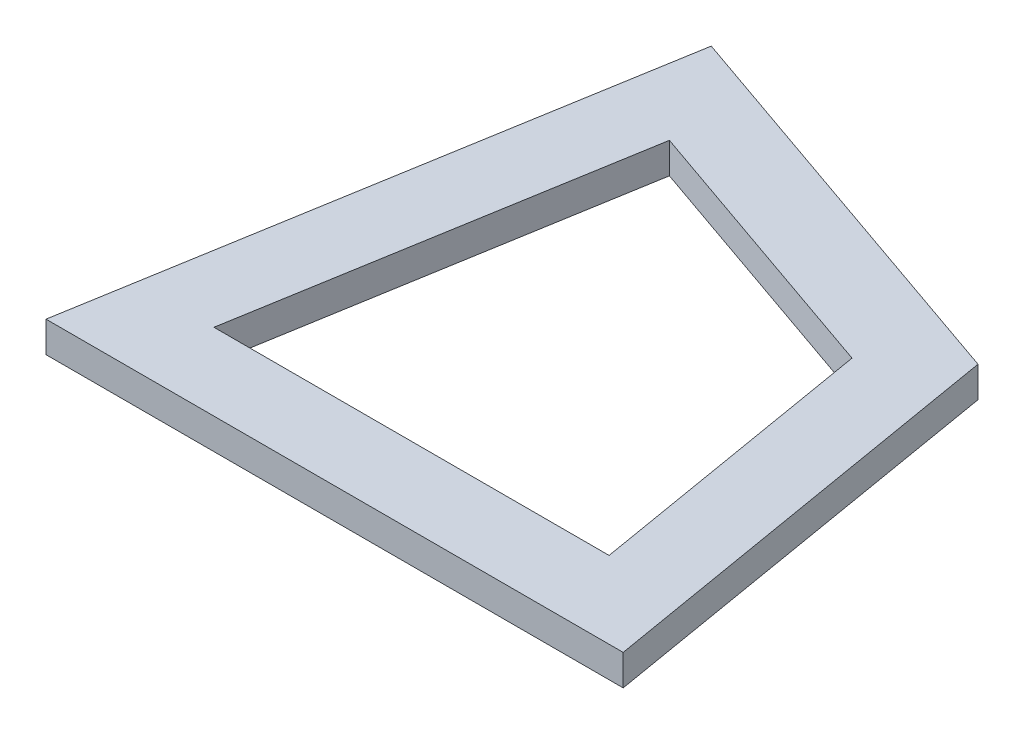
ISO-10303-21;
HEADER;
FILE_DESCRIPTION(('STEP AP214'),'2;1');
FILE_NAME('part.step','',(''),(''),'','','');
FILE_SCHEMA(('AUTOMOTIVE_DESIGN { 1 0 10303 214 1 1 1 1 }'));
ENDSEC;
DATA;
#1=APPLICATION_CONTEXT('core data for automotive mechanical design processes');
#2=APPLICATION_PROTOCOL_DEFINITION('international standard','automotive_design',2000,#1);
#3=PRODUCT_CONTEXT('',#1,'mechanical');
#4=PRODUCT('Part','Part','',(#3));
#5=PRODUCT_RELATED_PRODUCT_CATEGORY('part','',(#4));
#6=PRODUCT_DEFINITION_FORMATION('','',#4);
#7=PRODUCT_DEFINITION_CONTEXT('part definition',#1,'design');
#8=PRODUCT_DEFINITION('design','',#6,#7);
#9=PRODUCT_DEFINITION_SHAPE('','',#8);
#10=(LENGTH_UNIT() NAMED_UNIT(*) SI_UNIT(.MILLI.,.METRE.));
#11=(NAMED_UNIT(*) PLANE_ANGLE_UNIT() SI_UNIT($,.RADIAN.));
#12=(NAMED_UNIT(*) SI_UNIT($,.STERADIAN.) SOLID_ANGLE_UNIT());
#13=UNCERTAINTY_MEASURE_WITH_UNIT(LENGTH_MEASURE(1.E-05),#10,'distance_accuracy_value','');
#14=(GEOMETRIC_REPRESENTATION_CONTEXT(3) GLOBAL_UNCERTAINTY_ASSIGNED_CONTEXT((#13)) GLOBAL_UNIT_ASSIGNED_CONTEXT((#10,
#11,#12)) REPRESENTATION_CONTEXT('',''));
#15=CARTESIAN_POINT('',(0.,0.,0.));
#16=DIRECTION('',(0.,0.,1.));
#17=DIRECTION('',(1.,0.,0.));
#18=AXIS2_PLACEMENT_3D('',#15,#16,#17);
#19=CARTESIAN_POINT('',(0.,2.,0.));
#20=DIRECTION('',(0.,-1.,0.));
#21=DIRECTION('',(0.,0.,-1.));
#22=AXIS2_PLACEMENT_3D('',#19,#20,#21);
#23=PLANE('',#22);
#24=DIRECTION('',(-0.166596655404362,0.,0.986025128689974));
#25=VECTOR('',#24,1.);
#26=CARTESIAN_POINT('',(6.24939426390232,2.,-36.9878961155744));
#27=LINE('',#26,#25);
#28=CARTESIAN_POINT('',(6.24939426390232,2.,-36.9878961155744));
#29=VERTEX_POINT('',#28);
#30=CARTESIAN_POINT('',(0.,2.,0.));
#31=VERTEX_POINT('',#30);
#32=EDGE_CURVE('E140',#29,#31,#27,.T.);
#33=ORIENTED_EDGE('',*,*,#32,.T.);
#34=DIRECTION('',(1.,0.,0.));
#35=VECTOR('',#34,1.);
#36=CARTESIAN_POINT('',(0.,2.,0.));
#37=LINE('',#36,#35);
#38=CARTESIAN_POINT('',(37.51212321,2.,0.));
#39=VERTEX_POINT('',#38);
#40=EDGE_CURVE('E143',#31,#39,#37,.T.);
#41=ORIENTED_EDGE('',*,*,#40,.T.);
#42=DIRECTION('',(-0.166596655404362,0.,-0.986025128689974));
#43=VECTOR('',#42,1.);
#44=CARTESIAN_POINT('',(37.51212321,2.,0.));
#45=LINE('',#44,#43);
#46=CARTESIAN_POINT('',(32.8235622653046,2.,-27.7498902822694));
#47=VERTEX_POINT('',#46);
#48=EDGE_CURVE('E146',#39,#47,#45,.T.);
#49=ORIENTED_EDGE('',*,*,#48,.T.);
#50=DIRECTION('',(-0.944553945341675,0.,-0.328356276534311));
#51=VECTOR('',#50,1.);
#52=CARTESIAN_POINT('',(32.8235622653046,2.,-27.7498902822694));
#53=LINE('',#52,#51);
#54=EDGE_CURVE('E148',#47,#29,#53,.T.);
#55=ORIENTED_EDGE('',*,*,#54,.T.);
#56=EDGE_LOOP('',(#33,#41,#49,#55));
#57=FACE_BOUND('',#56,.T.);
#58=DIRECTION('',(-0.944553945341675,0.,-0.32835627653431));
#59=VECTOR('',#58,1.);
#60=CARTESIAN_POINT('',(28.3864635394444,2.,-23.9988596489901));
#61=LINE('',#60,#59);
#62=CARTESIAN_POINT('',(28.3864635394444,2.,-23.9988596489901));
#63=VERTEX_POINT('',#62);
#64=CARTESIAN_POINT('',(10.1941829697263,2.,-30.3230611824232));
#65=VERTEX_POINT('',#64);
#66=EDGE_CURVE('E104',#63,#65,#61,.T.);
#67=ORIENTED_EDGE('',*,*,#66,.F.);
#68=DIRECTION('',(-0.166596655404362,0.,-0.986025128689974));
#69=VECTOR('',#68,1.);
#70=CARTESIAN_POINT('',(31.5964694327261,2.,-5.));
#71=LINE('',#70,#69);
#72=CARTESIAN_POINT('',(31.5964694327261,2.,-5.));
#73=VERTEX_POINT('',#72);
#74=EDGE_CURVE('E126',#73,#63,#71,.T.);
#75=ORIENTED_EDGE('',*,*,#74,.F.);
#76=DIRECTION('',(1.,0.,0.));
#77=VECTOR('',#76,1.);
#78=CARTESIAN_POINT('',(5.91565377727388,2.,-5.));
#79=LINE('',#78,#77);
#80=CARTESIAN_POINT('',(5.91565377727388,2.,-5.));
#81=VERTEX_POINT('',#80);
#82=EDGE_CURVE('E124',#81,#73,#79,.T.);
#83=ORIENTED_EDGE('',*,*,#82,.F.);
#84=DIRECTION('',(-0.166596655404362,0.,0.986025128689974));
#85=VECTOR('',#84,1.);
#86=CARTESIAN_POINT('',(10.1941829697263,2.,-30.3230611824232));
#87=LINE('',#86,#85);
#88=EDGE_CURVE('E112',#65,#81,#87,.T.);
#89=ORIENTED_EDGE('',*,*,#88,.F.);
#90=EDGE_LOOP('',(#67,#75,#83,#89));
#91=FACE_BOUND('',#90,.T.);
#92=ADVANCED_FACE('F39',(#57,#91),#23,.F.);
#93=CARTESIAN_POINT('',(0.,0.,0.));
#94=DIRECTION('',(0.,-1.,0.));
#95=DIRECTION('',(0.,0.,-1.));
#96=AXIS2_PLACEMENT_3D('',#93,#94,#95);
#97=PLANE('',#96);
#98=DIRECTION('',(-0.166596655404362,0.,0.986025128689974));
#99=VECTOR('',#98,1.);
#100=CARTESIAN_POINT('',(6.24939426390232,0.,-36.9878961155744));
#101=LINE('',#100,#99);
#102=CARTESIAN_POINT('',(6.24939426390232,0.,-36.9878961155744));
#103=VERTEX_POINT('',#102);
#104=CARTESIAN_POINT('',(0.,0.,0.));
#105=VERTEX_POINT('',#104);
#106=EDGE_CURVE('E120',#103,#105,#101,.T.);
#107=ORIENTED_EDGE('',*,*,#106,.F.);
#108=DIRECTION('',(-0.944553945341675,0.,-0.328356276534311));
#109=VECTOR('',#108,1.);
#110=CARTESIAN_POINT('',(32.8235622653046,0.,-27.7498902822694));
#111=LINE('',#110,#109);
#112=CARTESIAN_POINT('',(32.8235622653046,0.,-27.7498902822694));
#113=VERTEX_POINT('',#112);
#114=EDGE_CURVE('E144',#113,#103,#111,.T.);
#115=ORIENTED_EDGE('',*,*,#114,.F.);
#116=DIRECTION('',(-0.166596655404362,0.,-0.986025128689974));
#117=VECTOR('',#116,1.);
#118=CARTESIAN_POINT('',(37.51212321,0.,0.));
#119=LINE('',#118,#117);
#120=CARTESIAN_POINT('',(37.51212321,0.,0.));
#121=VERTEX_POINT('',#120);
#122=EDGE_CURVE('E155',#121,#113,#119,.T.);
#123=ORIENTED_EDGE('',*,*,#122,.F.);
#124=DIRECTION('',(1.,0.,0.));
#125=VECTOR('',#124,1.);
#126=CARTESIAN_POINT('',(0.,0.,0.));
#127=LINE('',#126,#125);
#128=EDGE_CURVE('E153',#105,#121,#127,.T.);
#129=ORIENTED_EDGE('',*,*,#128,.F.);
#130=EDGE_LOOP('',(#107,#115,#123,#129));
#131=FACE_BOUND('',#130,.T.);
#132=DIRECTION('',(-0.166596655404362,0.,-0.986025128689974));
#133=VECTOR('',#132,1.);
#134=CARTESIAN_POINT('',(31.5964694327261,0.,-5.));
#135=LINE('',#134,#133);
#136=CARTESIAN_POINT('',(31.5964694327261,0.,-5.));
#137=VERTEX_POINT('',#136);
#138=CARTESIAN_POINT('',(28.3864635394444,0.,-23.9988596489901));
#139=VERTEX_POINT('',#138);
#140=EDGE_CURVE('E113',#137,#139,#135,.T.);
#141=ORIENTED_EDGE('',*,*,#140,.T.);
#142=DIRECTION('',(-0.944553945341675,0.,-0.32835627653431));
#143=VECTOR('',#142,1.);
#144=CARTESIAN_POINT('',(28.3864635394444,0.,-23.9988596489901));
#145=LINE('',#144,#143);
#146=CARTESIAN_POINT('',(10.1941829697263,0.,-30.3230611824232));
#147=VERTEX_POINT('',#146);
#148=EDGE_CURVE('E62',#139,#147,#145,.T.);
#149=ORIENTED_EDGE('',*,*,#148,.T.);
#150=DIRECTION('',(-0.166596655404362,0.,0.986025128689974));
#151=VECTOR('',#150,1.);
#152=CARTESIAN_POINT('',(10.1941829697263,0.,-30.3230611824232));
#153=LINE('',#152,#151);
#154=CARTESIAN_POINT('',(5.91565377727388,0.,-5.));
#155=VERTEX_POINT('',#154);
#156=EDGE_CURVE('E119',#147,#155,#153,.T.);
#157=ORIENTED_EDGE('',*,*,#156,.T.);
#158=DIRECTION('',(1.,0.,0.));
#159=VECTOR('',#158,1.);
#160=CARTESIAN_POINT('',(5.91565377727388,0.,-5.));
#161=LINE('',#160,#159);
#162=EDGE_CURVE('E132',#155,#137,#161,.T.);
#163=ORIENTED_EDGE('',*,*,#162,.T.);
#164=EDGE_LOOP('',(#141,#149,#157,#163));
#165=FACE_BOUND('',#164,.T.);
#166=ADVANCED_FACE('F173',(#131,#165),#97,.T.);
#167=CARTESIAN_POINT('',(6.24939426390232,2.,-36.9878961155744));
#168=DIRECTION('',(0.986025128689974,0.,0.166596655404362));
#169=DIRECTION('',(0.166596655404362,0.,-0.986025128689974));
#170=AXIS2_PLACEMENT_3D('',#167,#168,#169);
#171=PLANE('',#170);
#172=ORIENTED_EDGE('',*,*,#106,.T.);
#173=DIRECTION('',(0.,-1.,0.));
#174=VECTOR('',#173,1.);
#175=CARTESIAN_POINT('',(0.,2.,0.));
#176=LINE('',#175,#174);
#177=EDGE_CURVE('E11',#31,#105,#176,.T.);
#178=ORIENTED_EDGE('',*,*,#177,.F.);
#179=ORIENTED_EDGE('',*,*,#32,.F.);
#180=DIRECTION('',(0.,-1.,0.));
#181=VECTOR('',#180,1.);
#182=CARTESIAN_POINT('',(6.24939426390232,2.,-36.9878961155744));
#183=LINE('',#182,#181);
#184=EDGE_CURVE('E150',#29,#103,#183,.T.);
#185=ORIENTED_EDGE('',*,*,#184,.T.);
#186=EDGE_LOOP('',(#172,#178,#179,#185));
#187=FACE_BOUND('',#186,.T.);
#188=ADVANCED_FACE('F41',(#187),#171,.F.);
#189=CARTESIAN_POINT('',(0.,2.,0.));
#190=DIRECTION('',(0.,0.,-1.));
#191=DIRECTION('',(-1.,0.,0.));
#192=AXIS2_PLACEMENT_3D('',#189,#190,#191);
#193=PLANE('',#192);
#194=ORIENTED_EDGE('',*,*,#128,.T.);
#195=DIRECTION('',(0.,-1.,0.));
#196=VECTOR('',#195,1.);
#197=CARTESIAN_POINT('',(37.51212321,2.,0.));
#198=LINE('',#197,#196);
#199=EDGE_CURVE('E47',#39,#121,#198,.T.);
#200=ORIENTED_EDGE('',*,*,#199,.F.);
#201=ORIENTED_EDGE('',*,*,#40,.F.);
#202=ORIENTED_EDGE('',*,*,#177,.T.);
#203=EDGE_LOOP('',(#194,#200,#201,#202));
#204=FACE_BOUND('',#203,.T.);
#205=ADVANCED_FACE('F183',(#204),#193,.F.);
#206=CARTESIAN_POINT('',(37.51212321,2.,0.));
#207=DIRECTION('',(-0.986025128689974,0.,0.166596655404362));
#208=DIRECTION('',(0.166596655404362,0.,0.986025128689974));
#209=AXIS2_PLACEMENT_3D('',#206,#207,#208);
#210=PLANE('',#209);
#211=ORIENTED_EDGE('',*,*,#122,.T.);
#212=DIRECTION('',(0.,-1.,0.));
#213=VECTOR('',#212,1.);
#214=CARTESIAN_POINT('',(32.8235622653046,2.,-27.7498902822694));
#215=LINE('',#214,#213);
#216=EDGE_CURVE('E160',#47,#113,#215,.T.);
#217=ORIENTED_EDGE('',*,*,#216,.F.);
#218=ORIENTED_EDGE('',*,*,#48,.F.);
#219=ORIENTED_EDGE('',*,*,#199,.T.);
#220=EDGE_LOOP('',(#211,#217,#218,#219));
#221=FACE_BOUND('',#220,.T.);
#222=ADVANCED_FACE('F167',(#221),#210,.F.);
#223=CARTESIAN_POINT('',(32.8235622653046,2.,-27.7498902822694));
#224=DIRECTION('',(-0.328356276534311,0.,0.944553945341675));
#225=DIRECTION('',(0.944553945341675,0.,0.328356276534311));
#226=AXIS2_PLACEMENT_3D('',#223,#224,#225);
#227=PLANE('',#226);
#228=ORIENTED_EDGE('',*,*,#114,.T.);
#229=ORIENTED_EDGE('',*,*,#184,.F.);
#230=ORIENTED_EDGE('',*,*,#54,.F.);
#231=ORIENTED_EDGE('',*,*,#216,.T.);
#232=EDGE_LOOP('',(#228,#229,#230,#231));
#233=FACE_BOUND('',#232,.T.);
#234=ADVANCED_FACE('F177',(#233),#227,.F.);
#235=CARTESIAN_POINT('',(28.3864635394444,2.,-23.9988596489901));
#236=DIRECTION('',(-0.32835627653431,0.,0.944553945341675));
#237=DIRECTION('',(0.944553945341675,0.,0.32835627653431));
#238=AXIS2_PLACEMENT_3D('',#235,#236,#237);
#239=PLANE('',#238);
#240=ORIENTED_EDGE('',*,*,#148,.F.);
#241=DIRECTION('',(0.,-1.,0.));
#242=VECTOR('',#241,1.);
#243=CARTESIAN_POINT('',(28.3864635394444,2.,-23.9988596489901));
#244=LINE('',#243,#242);
#245=EDGE_CURVE('E108',#63,#139,#244,.T.);
#246=ORIENTED_EDGE('',*,*,#245,.F.);
#247=ORIENTED_EDGE('',*,*,#66,.T.);
#248=DIRECTION('',(0.,-1.,0.));
#249=VECTOR('',#248,1.);
#250=CARTESIAN_POINT('',(10.1941829697263,2.,-30.3230611824232));
#251=LINE('',#250,#249);
#252=EDGE_CURVE('E107',#65,#147,#251,.T.);
#253=ORIENTED_EDGE('',*,*,#252,.T.);
#254=EDGE_LOOP('',(#240,#246,#247,#253));
#255=FACE_BOUND('',#254,.T.);
#256=ADVANCED_FACE('F106',(#255),#239,.T.);
#257=CARTESIAN_POINT('',(10.1941829697263,2.,-30.3230611824232));
#258=DIRECTION('',(0.986025128689974,0.,0.166596655404362));
#259=DIRECTION('',(0.166596655404362,0.,-0.986025128689974));
#260=AXIS2_PLACEMENT_3D('',#257,#258,#259);
#261=PLANE('',#260);
#262=ORIENTED_EDGE('',*,*,#156,.F.);
#263=ORIENTED_EDGE('',*,*,#252,.F.);
#264=ORIENTED_EDGE('',*,*,#88,.T.);
#265=DIRECTION('',(0.,-1.,0.));
#266=VECTOR('',#265,1.);
#267=CARTESIAN_POINT('',(5.91565377727388,2.,-5.));
#268=LINE('',#267,#266);
#269=EDGE_CURVE('E121',#81,#155,#268,.T.);
#270=ORIENTED_EDGE('',*,*,#269,.T.);
#271=EDGE_LOOP('',(#262,#263,#264,#270));
#272=FACE_BOUND('',#271,.T.);
#273=ADVANCED_FACE('F116',(#272),#261,.T.);
#274=CARTESIAN_POINT('',(5.91565377727388,2.,-5.));
#275=DIRECTION('',(0.,0.,-1.));
#276=DIRECTION('',(-1.,0.,0.));
#277=AXIS2_PLACEMENT_3D('',#274,#275,#276);
#278=PLANE('',#277);
#279=ORIENTED_EDGE('',*,*,#162,.F.);
#280=ORIENTED_EDGE('',*,*,#269,.F.);
#281=ORIENTED_EDGE('',*,*,#82,.T.);
#282=DIRECTION('',(0.,-1.,0.));
#283=VECTOR('',#282,1.);
#284=CARTESIAN_POINT('',(31.5964694327261,2.,-5.));
#285=LINE('',#284,#283);
#286=EDGE_CURVE('E54',#73,#137,#285,.T.);
#287=ORIENTED_EDGE('',*,*,#286,.T.);
#288=EDGE_LOOP('',(#279,#280,#281,#287));
#289=FACE_BOUND('',#288,.T.);
#290=ADVANCED_FACE('F206',(#289),#278,.T.);
#291=CARTESIAN_POINT('',(31.5964694327261,2.,-5.));
#292=DIRECTION('',(-0.986025128689974,0.,0.166596655404362));
#293=DIRECTION('',(0.166596655404362,0.,0.986025128689974));
#294=AXIS2_PLACEMENT_3D('',#291,#292,#293);
#295=PLANE('',#294);
#296=ORIENTED_EDGE('',*,*,#140,.F.);
#297=ORIENTED_EDGE('',*,*,#286,.F.);
#298=ORIENTED_EDGE('',*,*,#74,.T.);
#299=ORIENTED_EDGE('',*,*,#245,.T.);
#300=EDGE_LOOP('',(#296,#297,#298,#299));
#301=FACE_BOUND('',#300,.T.);
#302=ADVANCED_FACE('F210',(#301),#295,.T.);
#303=CLOSED_SHELL('',(#92,#166,#188,#205,#222,#234,#256,#273,#290,#302));
#304=MANIFOLD_SOLID_BREP('B2',#303);
#305=ADVANCED_BREP_SHAPE_REPRESENTATION('',(#18,#304),#14);
#306=SHAPE_DEFINITION_REPRESENTATION(#9,#305);
ENDSEC;
END-ISO-10303-21;
